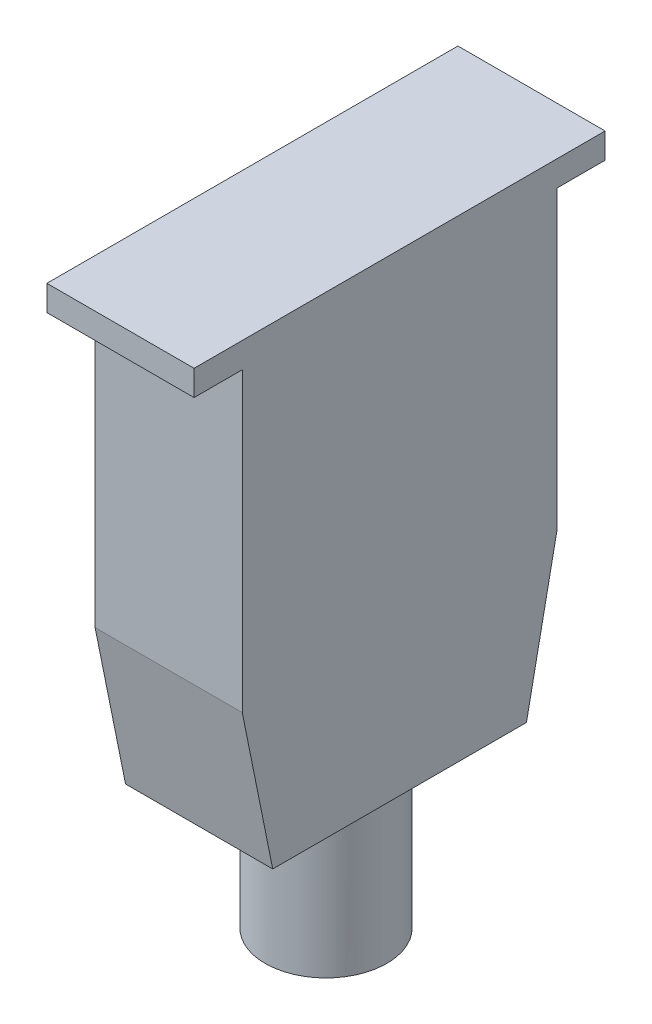
ISO-10303-21;
HEADER;
FILE_DESCRIPTION(('STEP AP214'),'2;1');
FILE_NAME('part.step','',(''),(''),'','','');
FILE_SCHEMA(('AUTOMOTIVE_DESIGN { 1 0 10303 214 1 1 1 1 }'));
ENDSEC;
DATA;
#1=APPLICATION_CONTEXT('core data for automotive mechanical design processes');
#2=APPLICATION_PROTOCOL_DEFINITION('international standard','automotive_design',2000,#1);
#3=PRODUCT_CONTEXT('',#1,'mechanical');
#4=PRODUCT('Part','Part','',(#3));
#5=PRODUCT_RELATED_PRODUCT_CATEGORY('part','',(#4));
#6=PRODUCT_DEFINITION_FORMATION('','',#4);
#7=PRODUCT_DEFINITION_CONTEXT('part definition',#1,'design');
#8=PRODUCT_DEFINITION('design','',#6,#7);
#9=PRODUCT_DEFINITION_SHAPE('','',#8);
#10=(LENGTH_UNIT() NAMED_UNIT(*) SI_UNIT(.MILLI.,.METRE.));
#11=(NAMED_UNIT(*) PLANE_ANGLE_UNIT() SI_UNIT($,.RADIAN.));
#12=(NAMED_UNIT(*) SI_UNIT($,.STERADIAN.) SOLID_ANGLE_UNIT());
#13=UNCERTAINTY_MEASURE_WITH_UNIT(LENGTH_MEASURE(1.E-05),#10,'distance_accuracy_value','');
#14=(GEOMETRIC_REPRESENTATION_CONTEXT(3) GLOBAL_UNCERTAINTY_ASSIGNED_CONTEXT((#13)) GLOBAL_UNIT_ASSIGNED_CONTEXT((#10,
#11,#12)) REPRESENTATION_CONTEXT('',''));
#15=CARTESIAN_POINT('',(0.,0.,0.));
#16=DIRECTION('',(0.,0.,1.));
#17=DIRECTION('',(1.,0.,0.));
#18=AXIS2_PLACEMENT_3D('',#15,#16,#17);
#19=CARTESIAN_POINT('',(413.25,-7.6,58.5));
#20=DIRECTION('',(0.,-1.,0.));
#21=DIRECTION('',(0.,0.,-1.));
#22=AXIS2_PLACEMENT_3D('',#19,#20,#21);
#23=PLANE('',#22);
#24=DIRECTION('',(-1.,0.,0.));
#25=VECTOR('',#24,1.);
#26=CARTESIAN_POINT('',(427.75,-7.6,89.5));
#27=LINE('',#26,#25);
#28=CARTESIAN_POINT('',(427.75,-7.6,89.5));
#29=VERTEX_POINT('',#28);
#30=CARTESIAN_POINT('',(398.75,-7.6,89.5));
#31=VERTEX_POINT('',#30);
#32=EDGE_CURVE('E34',#29,#31,#27,.T.);
#33=ORIENTED_EDGE('',*,*,#32,.F.);
#34=DIRECTION('',(0.,0.,1.));
#35=VECTOR('',#34,1.);
#36=CARTESIAN_POINT('',(427.75,-7.6,18.));
#37=LINE('',#36,#35);
#38=CARTESIAN_POINT('',(427.75,-7.6,99.));
#39=VERTEX_POINT('',#38);
#40=EDGE_CURVE('E143',#29,#39,#37,.T.);
#41=ORIENTED_EDGE('',*,*,#40,.T.);
#42=DIRECTION('',(-1.,0.,0.));
#43=VECTOR('',#42,1.);
#44=CARTESIAN_POINT('',(427.75,-7.6,99.));
#45=LINE('',#44,#43);
#46=CARTESIAN_POINT('',(398.75,-7.6,99.));
#47=VERTEX_POINT('',#46);
#48=EDGE_CURVE('E112',#39,#47,#45,.T.);
#49=ORIENTED_EDGE('',*,*,#48,.T.);
#50=DIRECTION('',(0.,0.,-1.));
#51=VECTOR('',#50,1.);
#52=CARTESIAN_POINT('',(398.75,-7.6,99.));
#53=LINE('',#52,#51);
#54=EDGE_CURVE('E129',#47,#31,#53,.T.);
#55=ORIENTED_EDGE('',*,*,#54,.T.);
#56=EDGE_LOOP('',(#33,#41,#49,#55));
#57=FACE_BOUND('',#56,.T.);
#58=ADVANCED_FACE('F17',(#57),#23,.T.);
#59=CARTESIAN_POINT('',(398.75,-7.6,99.));
#60=DIRECTION('',(1.,0.,0.));
#61=DIRECTION('',(0.,0.,-1.));
#62=AXIS2_PLACEMENT_3D('',#59,#60,#61);
#63=PLANE('',#62);
#64=DIRECTION('',(0.,0.,-1.));
#65=VECTOR('',#64,1.);
#66=CARTESIAN_POINT('',(398.75,-2.6,99.));
#67=LINE('',#66,#65);
#68=CARTESIAN_POINT('',(398.75,-2.6,99.));
#69=VERTEX_POINT('',#68);
#70=CARTESIAN_POINT('',(398.75,-2.6,18.));
#71=VERTEX_POINT('',#70);
#72=EDGE_CURVE('E102',#69,#71,#67,.T.);
#73=ORIENTED_EDGE('',*,*,#72,.T.);
#74=DIRECTION('',(0.,1.,0.));
#75=VECTOR('',#74,1.);
#76=CARTESIAN_POINT('',(398.75,-7.6,18.));
#77=LINE('',#76,#75);
#78=CARTESIAN_POINT('',(398.75,-7.6,18.));
#79=VERTEX_POINT('',#78);
#80=EDGE_CURVE('E11',#79,#71,#77,.T.);
#81=ORIENTED_EDGE('',*,*,#80,.F.);
#82=CARTESIAN_POINT('',(398.75,-7.6,27.5));
#83=VERTEX_POINT('',#82);
#84=EDGE_CURVE('E106',#83,#79,#53,.T.);
#85=ORIENTED_EDGE('',*,*,#84,.F.);
#86=DIRECTION('',(0.,1.,0.));
#87=VECTOR('',#86,1.);
#88=CARTESIAN_POINT('',(398.75,-28.6,27.5));
#89=LINE('',#88,#87);
#90=CARTESIAN_POINT('',(398.75,-66.1,27.5));
#91=VERTEX_POINT('',#90);
#92=EDGE_CURVE('E126',#91,#83,#89,.T.);
#93=ORIENTED_EDGE('',*,*,#92,.F.);
#94=DIRECTION('',(0.,0.98019801980198,-0.198019801980198));
#95=VECTOR('',#94,1.);
#96=CARTESIAN_POINT('',(398.75,-4.39896088618764,15.0351436133712));
#97=LINE('',#96,#95);
#98=CARTESIAN_POINT('',(398.75,-95.8,33.5));
#99=VERTEX_POINT('',#98);
#100=EDGE_CURVE('E197',#99,#91,#97,.T.);
#101=ORIENTED_EDGE('',*,*,#100,.F.);
#102=DIRECTION('',(0.,0.,-1.));
#103=VECTOR('',#102,1.);
#104=CARTESIAN_POINT('',(398.75,-95.8,89.5));
#105=LINE('',#104,#103);
#106=CARTESIAN_POINT('',(398.75,-95.8,83.5));
#107=VERTEX_POINT('',#106);
#108=EDGE_CURVE('E183',#107,#99,#105,.T.);
#109=ORIENTED_EDGE('',*,*,#108,.F.);
#110=DIRECTION('',(0.,0.98019801980198,0.198019801980198));
#111=VECTOR('',#110,1.);
#112=CARTESIAN_POINT('',(398.75,-20.1209489265758,98.7886971865503));
#113=LINE('',#112,#111);
#114=CARTESIAN_POINT('',(398.75,-66.1,89.5));
#115=VERTEX_POINT('',#114);
#116=EDGE_CURVE('E186',#107,#115,#113,.T.);
#117=ORIENTED_EDGE('',*,*,#116,.T.);
#118=DIRECTION('',(0.,1.,0.));
#119=VECTOR('',#118,1.);
#120=CARTESIAN_POINT('',(398.75,-28.6,89.5));
#121=LINE('',#120,#119);
#122=EDGE_CURVE('E163',#115,#31,#121,.T.);
#123=ORIENTED_EDGE('',*,*,#122,.T.);
#124=ORIENTED_EDGE('',*,*,#54,.F.);
#125=DIRECTION('',(0.,1.,0.));
#126=VECTOR('',#125,1.);
#127=CARTESIAN_POINT('',(398.75,-7.6,99.));
#128=LINE('',#127,#126);
#129=EDGE_CURVE('E114',#47,#69,#128,.T.);
#130=ORIENTED_EDGE('',*,*,#129,.T.);
#131=EDGE_LOOP('',(#73,#81,#85,#93,#101,#109,#117,#123,#124,#130));
#132=FACE_BOUND('',#131,.T.);
#133=ADVANCED_FACE('F19',(#132),#63,.F.);
#134=CARTESIAN_POINT('',(398.75,-7.6,18.));
#135=DIRECTION('',(0.,0.,1.));
#136=DIRECTION('',(1.,0.,0.));
#137=AXIS2_PLACEMENT_3D('',#134,#135,#136);
#138=PLANE('',#137);
#139=DIRECTION('',(1.,0.,0.));
#140=VECTOR('',#139,1.);
#141=CARTESIAN_POINT('',(398.75,-2.6,18.));
#142=LINE('',#141,#140);
#143=CARTESIAN_POINT('',(427.75,-2.6,18.));
#144=VERTEX_POINT('',#143);
#145=EDGE_CURVE('E120',#71,#144,#142,.T.);
#146=ORIENTED_EDGE('',*,*,#145,.T.);
#147=DIRECTION('',(0.,1.,0.));
#148=VECTOR('',#147,1.);
#149=CARTESIAN_POINT('',(427.75,-7.6,18.));
#150=LINE('',#149,#148);
#151=CARTESIAN_POINT('',(427.75,-7.6,18.));
#152=VERTEX_POINT('',#151);
#153=EDGE_CURVE('E26',#152,#144,#150,.T.);
#154=ORIENTED_EDGE('',*,*,#153,.F.);
#155=DIRECTION('',(1.,0.,0.));
#156=VECTOR('',#155,1.);
#157=CARTESIAN_POINT('',(398.75,-7.6,18.));
#158=LINE('',#157,#156);
#159=EDGE_CURVE('E131',#79,#152,#158,.T.);
#160=ORIENTED_EDGE('',*,*,#159,.F.);
#161=ORIENTED_EDGE('',*,*,#80,.T.);
#162=EDGE_LOOP('',(#146,#154,#160,#161));
#163=FACE_BOUND('',#162,.T.);
#164=ADVANCED_FACE('F149',(#163),#138,.F.);
#165=CARTESIAN_POINT('',(427.75,-7.6,18.));
#166=DIRECTION('',(-1.,0.,0.));
#167=DIRECTION('',(0.,0.,1.));
#168=AXIS2_PLACEMENT_3D('',#165,#166,#167);
#169=PLANE('',#168);
#170=DIRECTION('',(0.,0.,1.));
#171=VECTOR('',#170,1.);
#172=CARTESIAN_POINT('',(427.75,-2.6,18.));
#173=LINE('',#172,#171);
#174=CARTESIAN_POINT('',(427.75,-2.6,99.));
#175=VERTEX_POINT('',#174);
#176=EDGE_CURVE('E99',#144,#175,#173,.T.);
#177=ORIENTED_EDGE('',*,*,#176,.T.);
#178=DIRECTION('',(0.,1.,0.));
#179=VECTOR('',#178,1.);
#180=CARTESIAN_POINT('',(427.75,-7.6,99.));
#181=LINE('',#180,#179);
#182=EDGE_CURVE('E110',#39,#175,#181,.T.);
#183=ORIENTED_EDGE('',*,*,#182,.F.);
#184=ORIENTED_EDGE('',*,*,#40,.F.);
#185=DIRECTION('',(0.,1.,0.));
#186=VECTOR('',#185,1.);
#187=CARTESIAN_POINT('',(427.75,-28.6,89.5));
#188=LINE('',#187,#186);
#189=CARTESIAN_POINT('',(427.75,-66.1,89.5));
#190=VERTEX_POINT('',#189);
#191=EDGE_CURVE('E158',#190,#29,#188,.T.);
#192=ORIENTED_EDGE('',*,*,#191,.F.);
#193=DIRECTION('',(0.,-0.98019801980198,-0.198019801980198));
#194=VECTOR('',#193,1.);
#195=CARTESIAN_POINT('',(427.75,-66.1,89.5));
#196=LINE('',#195,#194);
#197=CARTESIAN_POINT('',(427.75,-95.8,83.5));
#198=VERTEX_POINT('',#197);
#199=EDGE_CURVE('E194',#190,#198,#196,.T.);
#200=ORIENTED_EDGE('',*,*,#199,.T.);
#201=DIRECTION('',(0.,0.,1.));
#202=VECTOR('',#201,1.);
#203=CARTESIAN_POINT('',(427.75,-95.8,27.5));
#204=LINE('',#203,#202);
#205=CARTESIAN_POINT('',(427.75,-95.8,33.5));
#206=VERTEX_POINT('',#205);
#207=EDGE_CURVE('E184',#206,#198,#204,.T.);
#208=ORIENTED_EDGE('',*,*,#207,.F.);
#209=DIRECTION('',(0.,-0.98019801980198,0.198019801980198));
#210=VECTOR('',#209,1.);
#211=CARTESIAN_POINT('',(427.75,-66.1,27.5));
#212=LINE('',#211,#210);
#213=CARTESIAN_POINT('',(427.75,-66.1,27.5));
#214=VERTEX_POINT('',#213);
#215=EDGE_CURVE('E154',#214,#206,#212,.T.);
#216=ORIENTED_EDGE('',*,*,#215,.F.);
#217=DIRECTION('',(0.,1.,0.));
#218=VECTOR('',#217,1.);
#219=CARTESIAN_POINT('',(427.75,-28.6,27.5));
#220=LINE('',#219,#218);
#221=CARTESIAN_POINT('',(427.75,-7.6,27.5));
#222=VERTEX_POINT('',#221);
#223=EDGE_CURVE('E152',#214,#222,#220,.T.);
#224=ORIENTED_EDGE('',*,*,#223,.T.);
#225=EDGE_CURVE('E137',#152,#222,#37,.T.);
#226=ORIENTED_EDGE('',*,*,#225,.F.);
#227=ORIENTED_EDGE('',*,*,#153,.T.);
#228=EDGE_LOOP('',(#177,#183,#184,#192,#200,#208,#216,#224,#226,#227));
#229=FACE_BOUND('',#228,.T.);
#230=ADVANCED_FACE('F117',(#229),#169,.F.);
#231=CARTESIAN_POINT('',(427.75,-7.6,99.));
#232=DIRECTION('',(0.,0.,-1.));
#233=DIRECTION('',(-1.,0.,0.));
#234=AXIS2_PLACEMENT_3D('',#231,#232,#233);
#235=PLANE('',#234);
#236=DIRECTION('',(-1.,0.,0.));
#237=VECTOR('',#236,1.);
#238=CARTESIAN_POINT('',(427.75,-2.6,99.));
#239=LINE('',#238,#237);
#240=EDGE_CURVE('E95',#175,#69,#239,.T.);
#241=ORIENTED_EDGE('',*,*,#240,.T.);
#242=ORIENTED_EDGE('',*,*,#129,.F.);
#243=ORIENTED_EDGE('',*,*,#48,.F.);
#244=ORIENTED_EDGE('',*,*,#182,.T.);
#245=EDGE_LOOP('',(#241,#242,#243,#244));
#246=FACE_BOUND('',#245,.T.);
#247=ADVANCED_FACE('F111',(#246),#235,.F.);
#248=DIRECTION('',(1.,0.,0.));
#249=VECTOR('',#248,1.);
#250=CARTESIAN_POINT('',(398.75,-7.6,27.5));
#251=LINE('',#250,#249);
#252=EDGE_CURVE('E42',#83,#222,#251,.T.);
#253=ORIENTED_EDGE('',*,*,#252,.F.);
#254=ORIENTED_EDGE('',*,*,#84,.T.);
#255=ORIENTED_EDGE('',*,*,#159,.T.);
#256=ORIENTED_EDGE('',*,*,#225,.T.);
#257=EDGE_LOOP('',(#253,#254,#255,#256));
#258=FACE_BOUND('',#257,.T.);
#259=ADVANCED_FACE('F146',(#258),#23,.T.);
#260=CARTESIAN_POINT('',(398.75,-28.6,27.5));
#261=DIRECTION('',(0.,0.,1.));
#262=DIRECTION('',(1.,0.,0.));
#263=AXIS2_PLACEMENT_3D('',#260,#261,#262);
#264=PLANE('',#263);
#265=ORIENTED_EDGE('',*,*,#252,.T.);
#266=ORIENTED_EDGE('',*,*,#223,.F.);
#267=DIRECTION('',(-1.,0.,0.));
#268=VECTOR('',#267,1.);
#269=CARTESIAN_POINT('',(398.75,-66.1,27.5));
#270=LINE('',#269,#268);
#271=EDGE_CURVE('E178',#214,#91,#270,.T.);
#272=ORIENTED_EDGE('',*,*,#271,.T.);
#273=ORIENTED_EDGE('',*,*,#92,.T.);
#274=EDGE_LOOP('',(#265,#266,#272,#273));
#275=FACE_BOUND('',#274,.T.);
#276=ADVANCED_FACE('F231',(#275),#264,.F.);
#277=CARTESIAN_POINT('',(427.75,-28.6,89.5));
#278=DIRECTION('',(0.,0.,-1.));
#279=DIRECTION('',(-1.,0.,0.));
#280=AXIS2_PLACEMENT_3D('',#277,#278,#279);
#281=PLANE('',#280);
#282=ORIENTED_EDGE('',*,*,#32,.T.);
#283=ORIENTED_EDGE('',*,*,#122,.F.);
#284=DIRECTION('',(1.,0.,0.));
#285=VECTOR('',#284,1.);
#286=CARTESIAN_POINT('',(297.342872894105,-66.1,89.5));
#287=LINE('',#286,#285);
#288=EDGE_CURVE('E191',#115,#190,#287,.T.);
#289=ORIENTED_EDGE('',*,*,#288,.T.);
#290=ORIENTED_EDGE('',*,*,#191,.T.);
#291=EDGE_LOOP('',(#282,#283,#289,#290));
#292=FACE_BOUND('',#291,.T.);
#293=ADVANCED_FACE('F236',(#292),#281,.F.);
#294=CARTESIAN_POINT('',(413.25,-95.8,58.5));
#295=DIRECTION('',(0.,-1.,0.));
#296=DIRECTION('',(1.,0.,0.));
#297=AXIS2_PLACEMENT_3D('',#294,#295,#296);
#298=PLANE('',#297);
#299=CARTESIAN_POINT('',(413.25,-95.8,58.5));
#300=DIRECTION('',(0.,-1.,0.));
#301=DIRECTION('',(1.,0.,0.));
#302=AXIS2_PLACEMENT_3D('',#299,#300,#301);
#303=CIRCLE('',#302,12.);
#304=CARTESIAN_POINT('',(425.25,-95.8,58.5));
#305=VERTEX_POINT('',#304);
#306=EDGE_CURVE('E175',#305,#305,#303,.T.);
#307=ORIENTED_EDGE('',*,*,#306,.F.);
#308=EDGE_LOOP('',(#307));
#309=FACE_BOUND('',#308,.T.);
#310=DIRECTION('',(1.,0.,0.));
#311=VECTOR('',#310,1.);
#312=CARTESIAN_POINT('',(297.342872894105,-95.8,33.5));
#313=LINE('',#312,#311);
#314=EDGE_CURVE('E200',#99,#206,#313,.T.);
#315=ORIENTED_EDGE('',*,*,#314,.T.);
#316=ORIENTED_EDGE('',*,*,#207,.T.);
#317=DIRECTION('',(-1.,0.,0.));
#318=VECTOR('',#317,1.);
#319=CARTESIAN_POINT('',(413.25,-95.8,83.5));
#320=LINE('',#319,#318);
#321=EDGE_CURVE('E180',#198,#107,#320,.T.);
#322=ORIENTED_EDGE('',*,*,#321,.T.);
#323=ORIENTED_EDGE('',*,*,#108,.T.);
#324=EDGE_LOOP('',(#315,#316,#322,#323));
#325=FACE_BOUND('',#324,.T.);
#326=ADVANCED_FACE('F285',(#309,#325),#298,.T.);
#327=CARTESIAN_POINT('',(297.342872894105,-66.1,89.5));
#328=DIRECTION('',(0.,-0.198019801980198,0.98019801980198));
#329=DIRECTION('',(0.,-0.98019801980198,-0.198019801980198));
#330=AXIS2_PLACEMENT_3D('',#327,#328,#329);
#331=PLANE('',#330);
#332=ORIENTED_EDGE('',*,*,#321,.F.);
#333=ORIENTED_EDGE('',*,*,#199,.F.);
#334=ORIENTED_EDGE('',*,*,#288,.F.);
#335=ORIENTED_EDGE('',*,*,#116,.F.);
#336=EDGE_LOOP('',(#332,#333,#334,#335));
#337=FACE_BOUND('',#336,.T.);
#338=ADVANCED_FACE('F296',(#337),#331,.T.);
#339=CARTESIAN_POINT('',(297.342872894105,-66.1,27.5));
#340=DIRECTION('',(0.,0.198019801980198,0.98019801980198));
#341=DIRECTION('',(0.,-0.98019801980198,0.198019801980198));
#342=AXIS2_PLACEMENT_3D('',#339,#340,#341);
#343=PLANE('',#342);
#344=ORIENTED_EDGE('',*,*,#100,.T.);
#345=ORIENTED_EDGE('',*,*,#271,.F.);
#346=ORIENTED_EDGE('',*,*,#215,.T.);
#347=ORIENTED_EDGE('',*,*,#314,.F.);
#348=EDGE_LOOP('',(#344,#345,#346,#347));
#349=FACE_BOUND('',#348,.T.);
#350=ADVANCED_FACE('F220',(#349),#343,.F.);
#351=CARTESIAN_POINT('',(413.25,-125.67,58.5));
#352=DIRECTION('',(0.,1.,0.));
#353=DIRECTION('',(-1.,0.,0.));
#354=AXIS2_PLACEMENT_3D('',#351,#352,#353);
#355=CYLINDRICAL_SURFACE('',#354,12.);
#356=CARTESIAN_POINT('',(413.25,-125.67,58.5));
#357=DIRECTION('',(0.,1.,0.));
#358=DIRECTION('',(-1.,0.,0.));
#359=AXIS2_PLACEMENT_3D('',#356,#357,#358);
#360=CIRCLE('',#359,12.);
#361=CARTESIAN_POINT('',(401.25,-125.67,58.5));
#362=VERTEX_POINT('',#361);
#363=EDGE_CURVE('E204',#362,#362,#360,.T.);
#364=ORIENTED_EDGE('',*,*,#363,.T.);
#365=EDGE_LOOP('',(#364));
#366=FACE_BOUND('',#365,.T.);
#367=ORIENTED_EDGE('',*,*,#306,.T.);
#368=EDGE_LOOP('',(#367));
#369=FACE_BOUND('',#368,.T.);
#370=ADVANCED_FACE('F208',(#366,#369),#355,.T.);
#371=CARTESIAN_POINT('',(413.25,-125.67,58.5));
#372=DIRECTION('',(0.,1.,0.));
#373=DIRECTION('',(-1.,0.,0.));
#374=AXIS2_PLACEMENT_3D('',#371,#372,#373);
#375=PLANE('',#374);
#376=ORIENTED_EDGE('',*,*,#363,.F.);
#377=EDGE_LOOP('',(#376));
#378=FACE_BOUND('',#377,.T.);
#379=ADVANCED_FACE('F211',(#378),#375,.F.);
#380=CARTESIAN_POINT('',(0.,-2.6,0.));
#381=DIRECTION('',(0.,1.,0.));
#382=DIRECTION('',(0.,0.,1.));
#383=AXIS2_PLACEMENT_3D('',#380,#381,#382);
#384=PLANE('',#383);
#385=ORIENTED_EDGE('',*,*,#72,.F.);
#386=ORIENTED_EDGE('',*,*,#240,.F.);
#387=ORIENTED_EDGE('',*,*,#176,.F.);
#388=ORIENTED_EDGE('',*,*,#145,.F.);
#389=EDGE_LOOP('',(#385,#386,#387,#388));
#390=FACE_BOUND('',#389,.T.);
#391=ADVANCED_FACE('F97',(#390),#384,.T.);
#392=CLOSED_SHELL('',(#58,#133,#164,#230,#247,#259,#276,#293,#326,#338,#350,#370,#379,#391));
#393=MANIFOLD_SOLID_BREP('B1',#392);
#394=ADVANCED_BREP_SHAPE_REPRESENTATION('',(#18,#393),#14);
#395=SHAPE_DEFINITION_REPRESENTATION(#9,#394);
ENDSEC;
END-ISO-10303-21;
